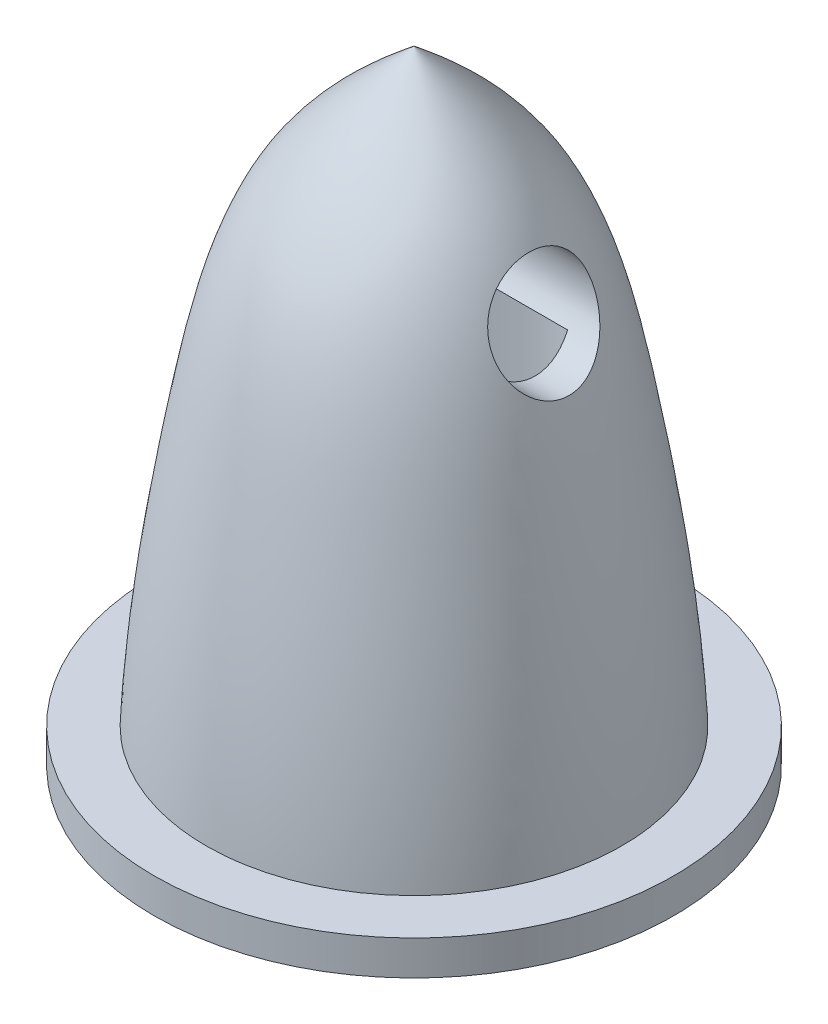
ISO-10303-21;
HEADER;
FILE_DESCRIPTION(('STEP AP214'),'2;1');
FILE_NAME('part.step','',(''),(''),'','','');
FILE_SCHEMA(('AUTOMOTIVE_DESIGN { 1 0 10303 214 1 1 1 1 }'));
ENDSEC;
DATA;
#1=APPLICATION_CONTEXT('core data for automotive mechanical design processes');
#2=APPLICATION_PROTOCOL_DEFINITION('international standard','automotive_design',2000,#1);
#3=PRODUCT_CONTEXT('',#1,'mechanical');
#4=PRODUCT('Part','Part','',(#3));
#5=PRODUCT_RELATED_PRODUCT_CATEGORY('part','',(#4));
#6=PRODUCT_DEFINITION_FORMATION('','',#4);
#7=PRODUCT_DEFINITION_CONTEXT('part definition',#1,'design');
#8=PRODUCT_DEFINITION('design','',#6,#7);
#9=PRODUCT_DEFINITION_SHAPE('','',#8);
#10=(LENGTH_UNIT() NAMED_UNIT(*) SI_UNIT(.MILLI.,.METRE.));
#11=(NAMED_UNIT(*) PLANE_ANGLE_UNIT() SI_UNIT($,.RADIAN.));
#12=(NAMED_UNIT(*) SI_UNIT($,.STERADIAN.) SOLID_ANGLE_UNIT());
#13=UNCERTAINTY_MEASURE_WITH_UNIT(LENGTH_MEASURE(1.E-05),#10,'distance_accuracy_value','');
#14=(GEOMETRIC_REPRESENTATION_CONTEXT(3) GLOBAL_UNCERTAINTY_ASSIGNED_CONTEXT((#13)) GLOBAL_UNIT_ASSIGNED_CONTEXT((#10,
#11,#12)) REPRESENTATION_CONTEXT('',''));
#15=CARTESIAN_POINT('',(0.,0.,0.));
#16=DIRECTION('',(0.,0.,1.));
#17=DIRECTION('',(1.,0.,0.));
#18=AXIS2_PLACEMENT_3D('',#15,#16,#17);
#19=CARTESIAN_POINT('',(0.,11.,0.));
#20=DIRECTION('',(0.,-1.,0.));
#21=DIRECTION('',(0.,0.,-1.));
#22=AXIS2_PLACEMENT_3D('',#19,#20,#21);
#23=PLANE('',#22);
#24=DIRECTION('',(1.,0.,0.));
#25=VECTOR('',#24,1.);
#26=CARTESIAN_POINT('',(-6.,11.,-1.1180339887499));
#27=LINE('',#26,#25);
#28=CARTESIAN_POINT('',(-3.3166247903554,11.,-1.1180339887499));
#29=VERTEX_POINT('',#28);
#30=CARTESIAN_POINT('',(3.3166247903554,11.,-1.1180339887499));
#31=VERTEX_POINT('',#30);
#32=EDGE_CURVE('E12',#29,#31,#27,.T.);
#33=ORIENTED_EDGE('',*,*,#32,.F.);
#34=CARTESIAN_POINT('',(0.,11.,0.));
#35=DIRECTION('',(0.,-1.,0.));
#36=DIRECTION('',(0.,0.,-1.));
#37=AXIS2_PLACEMENT_3D('',#34,#35,#36);
#38=CIRCLE('',#37,3.5);
#39=EDGE_CURVE('E103',#29,#31,#38,.T.);
#40=ORIENTED_EDGE('',*,*,#39,.T.);
#41=EDGE_LOOP('',(#33,#40));
#42=FACE_BOUND('',#41,.T.);
#43=ADVANCED_FACE('F61',(#42),#23,.T.);
#44=CARTESIAN_POINT('',(0.,-1.,0.));
#45=DIRECTION('',(0.,1.,0.));
#46=DIRECTION('',(0.,0.,1.));
#47=AXIS2_PLACEMENT_3D('',#44,#45,#46);
#48=CYLINDRICAL_SURFACE('',#47,7.5);
#49=CARTESIAN_POINT('',(0.,-1.,0.));
#50=DIRECTION('',(0.,-1.,0.));
#51=DIRECTION('',(0.,0.,-1.));
#52=AXIS2_PLACEMENT_3D('',#49,#50,#51);
#53=CIRCLE('',#52,7.5);
#54=CARTESIAN_POINT('',(0.,-1.,-7.5));
#55=VERTEX_POINT('',#54);
#56=EDGE_CURVE('E110',#55,#55,#53,.T.);
#57=ORIENTED_EDGE('',*,*,#56,.F.);
#58=EDGE_LOOP('',(#57));
#59=FACE_BOUND('',#58,.T.);
#60=CARTESIAN_POINT('',(0.,0.,0.));
#61=DIRECTION('',(0.,-1.,0.));
#62=DIRECTION('',(0.,0.,-1.));
#63=AXIS2_PLACEMENT_3D('',#60,#61,#62);
#64=CIRCLE('',#63,7.5);
#65=CARTESIAN_POINT('',(0.,0.,-7.5));
#66=VERTEX_POINT('',#65);
#67=EDGE_CURVE('E107',#66,#66,#64,.T.);
#68=ORIENTED_EDGE('',*,*,#67,.T.);
#69=EDGE_LOOP('',(#68));
#70=FACE_BOUND('',#69,.T.);
#71=ADVANCED_FACE('F144',(#59,#70),#48,.T.);
#72=CARTESIAN_POINT('',(0.,-1.,0.));
#73=DIRECTION('',(0.,-1.,0.));
#74=DIRECTION('',(0.,0.,-1.));
#75=AXIS2_PLACEMENT_3D('',#72,#73,#74);
#76=PLANE('',#75);
#77=CARTESIAN_POINT('',(0.,-1.,0.));
#78=DIRECTION('',(0.,-1.,0.));
#79=DIRECTION('',(0.,0.,-1.));
#80=AXIS2_PLACEMENT_3D('',#77,#78,#79);
#81=CIRCLE('',#80,3.5);
#82=CARTESIAN_POINT('',(0.,-1.,-3.5));
#83=VERTEX_POINT('',#82);
#84=EDGE_CURVE('E112',#83,#83,#81,.T.);
#85=ORIENTED_EDGE('',*,*,#84,.F.);
#86=EDGE_LOOP('',(#85));
#87=FACE_BOUND('',#86,.T.);
#88=ORIENTED_EDGE('',*,*,#56,.T.);
#89=EDGE_LOOP('',(#88));
#90=FACE_BOUND('',#89,.T.);
#91=ADVANCED_FACE('F142',(#87,#90),#76,.T.);
#92=CARTESIAN_POINT('',(0.,0.,0.));
#93=DIRECTION('',(0.,-1.,0.));
#94=DIRECTION('',(0.,0.,-1.));
#95=AXIS2_PLACEMENT_3D('',#92,#93,#94);
#96=PLANE('',#95);
#97=CARTESIAN_POINT('',(0.,0.,0.));
#98=DIRECTION('',(0.,1.,0.));
#99=DIRECTION('',(0.,0.,1.));
#100=AXIS2_PLACEMENT_3D('',#97,#98,#99);
#101=CIRCLE('',#100,6.);
#102=CARTESIAN_POINT('',(0.,0.,6.));
#103=VERTEX_POINT('',#102);
#104=EDGE_CURVE('E96',#103,#103,#101,.T.);
#105=ORIENTED_EDGE('',*,*,#104,.F.);
#106=EDGE_LOOP('',(#105));
#107=FACE_BOUND('',#106,.T.);
#108=ORIENTED_EDGE('',*,*,#67,.F.);
#109=EDGE_LOOP('',(#108));
#110=FACE_BOUND('',#109,.T.);
#111=ADVANCED_FACE('F133',(#107,#110),#96,.F.);
#112=CARTESIAN_POINT('',(-1.63771161310395,0.,5.77216602951651));
#113=CARTESIAN_POINT('',(-1.25604982510826,2.70999310695008,5.74792936969275));
#114=CARTESIAN_POINT('',(-0.635456728813944,7.31760669771987,5.1568188376751));
#115=CARTESIAN_POINT('',(-0.352139289046343,13.7590379220788,3.85194242465393));
#116=CARTESIAN_POINT('',(-0.100865045013086,16.07167477319,1.10333143201014));
#117=CARTESIAN_POINT('',(0.,17.000000002,0.));
#118=CARTESIAN_POINT('',(-0.882136892437624,0.,5.98654196539144));
#119=CARTESIAN_POINT('',(-0.503646763529838,2.70999312095589,5.91235254958714));
#120=CARTESIAN_POINT('',(0.0395689066733885,7.31760669263702,5.23999750976852));
#121=CARTESIAN_POINT('',(0.152078810977699,13.7590379227889,3.89803768425039));
#122=CARTESIAN_POINT('',(0.0435607062090235,16.0716747733933,1.11653473132581));
#123=CARTESIAN_POINT('',(0.,17.000000002,0.));
#124=CARTESIAN_POINT('',(0.71384083025026,0.,6.11502855023513));
#125=CARTESIAN_POINT('',(1.0661409577533,2.70999776741628,5.94219115082974));
#126=CARTESIAN_POINT('',(1.42235793060396,7.31760500638751,5.13815613528719));
#127=CARTESIAN_POINT('',(1.17872221394427,13.7590381583456,3.78987603233073));
#128=CARTESIAN_POINT('',(0.337627390256263,16.071674840865,1.08555344003306));
#129=CARTESIAN_POINT('',(0.,17.000000002,0.));
#130=CARTESIAN_POINT('',(2.99974212154382,0.,5.37610548765391));
#131=CARTESIAN_POINT('',(3.25906203455601,2.70999510867615,5.08160902885469));
#132=CARTESIAN_POINT('',(3.28044048658949,7.31760597127237,4.20247574740558));
#133=CARTESIAN_POINT('',(2.53927327409422,13.7590380235582,3.05016393498515));
#134=CARTESIAN_POINT('',(0.727336940406932,16.0716748022572,0.873673947126867));
#135=CARTESIAN_POINT('',(0.,17.000000002,0.));
#136=CARTESIAN_POINT('',(4.82869105918587,0.,3.81906030783793));
#137=CARTESIAN_POINT('',(4.95558505465482,2.70999625310538,3.44774526542495));
#138=CARTESIAN_POINT('',(4.63892720870308,7.31760555594693,2.62734319795501));
#139=CARTESIAN_POINT('',(3.51322865939837,13.7590380815762,1.8463378548351));
#140=CARTESIAN_POINT('',(1.00631192796224,16.0716748188756,0.528855928975302));
#141=CARTESIAN_POINT('',(0.,17.000000002,0.));
#142=CARTESIAN_POINT('',(5.92266548789641,0.,1.6803836373626));
#143=CARTESIAN_POINT('',(5.89779365186575,2.70999592627188,1.28876682822311));
#144=CARTESIAN_POINT('',(5.29126931936783,7.31760567455823,0.651989804057528));
#145=CARTESIAN_POINT('',(3.95236241735653,13.759038065007,0.361309095362077));
#146=CARTESIAN_POINT('',(1.13209524053486,16.0716748141296,0.103491599207884));
#147=CARTESIAN_POINT('',(0.,17.000000002,0.));
#148=CARTESIAN_POINT('',(6.11486138425387,0.,-0.714025674898327));
#149=CARTESIAN_POINT('',(5.94202187773725,2.70999568297413,-1.06630218542331));
#150=CARTESIAN_POINT('',(5.13798913040761,7.31760576285357,-1.42248468992361));
#151=CARTESIAN_POINT('',(3.78977378527252,13.7590380526728,-1.1786824222702));
#152=CARTESIAN_POINT('',(1.08552415288888,16.0716748105967,-0.337615992524966));
#153=CARTESIAN_POINT('',(0.,17.000000002,0.));
#154=CARTESIAN_POINT('',(5.37614790683815,0.,-2.99975491372685));
#155=CARTESIAN_POINT('',(5.08164780454236,2.70999669982789,-3.2590934754347));
#156=CARTESIAN_POINT('',(4.20250283246498,7.31760539382662,-3.280505239161));
#157=CARTESIAN_POINT('',(3.05024126916232,13.7590381042232,-2.53921716056614));
#158=CARTESIAN_POINT('',(0.873696098348003,16.0716748253625,-0.727320867524091));
#159=CARTESIAN_POINT('',(0.,17.000000002,0.));
#160=CARTESIAN_POINT('',(3.81895824410904,0.,-4.82877220781337));
#161=CARTESIAN_POINT('',(3.44763809473317,2.70999311461883,-4.95562886197896));
#162=CARTESIAN_POINT('',(2.6272247999729,7.31760669493676,-4.6389121088972));
#163=CARTESIAN_POINT('',(1.84637729365055,13.7590379224677,-3.51324903623568));
#164=CARTESIAN_POINT('',(0.528867225635514,16.0716747733013,-1.00631776460324));
#165=CARTESIAN_POINT('',(0.,17.000000002,0.));
#166=CARTESIAN_POINT('',(1.68039992903456,0.,-5.92262234007832));
#167=CARTESIAN_POINT('',(1.28879681547105,2.71000178920933,-5.89780900009984));
#168=CARTESIAN_POINT('',(0.652040128986993,7.31760354683644,-5.29137711098396));
#169=CARTESIAN_POINT('',(0.36131470629204,13.7590383622341,-3.9523201520249));
#170=CARTESIAN_POINT('',(0.10349320637505,16.0716748992659,-1.13208313426126));
#171=CARTESIAN_POINT('',(0.,17.000000002,0.));
#172=CARTESIAN_POINT('',(-0.713963734535338,0.,-6.11487848538034));
#173=CARTESIAN_POINT('',(-1.06625717603406,2.70999272123677,-5.9420152196477));
#174=CARTESIAN_POINT('',(-1.42245923032158,7.31760683769923,-5.13794328948983));
#175=CARTESIAN_POINT('',(-1.17874152322678,13.7590379025249,-3.78980167150487));
#176=CARTESIAN_POINT('',(-0.33763292111212,16.071674767589,-1.08553214048404));
#177=CARTESIAN_POINT('',(0.,17.000000002,0.));
#178=CARTESIAN_POINT('',(-2.99967702524025,0.,-5.37619136590899));
#179=CARTESIAN_POINT('',(-3.25900048738126,2.7099973817705,-5.08171026880177));
#180=CARTESIAN_POINT('',(-3.28038670640696,7.31760514634248,-4.20259636613019));
#181=CARTESIAN_POINT('',(-2.53926499119674,13.7590381387948,-3.05020243148964));
#182=CARTESIAN_POINT('',(-0.727334567894539,16.071674835265,-0.873684973876165));
#183=CARTESIAN_POINT('',(0.,17.000000002,0.));
#184=CARTESIAN_POINT('',(-4.82872512534189,0.,-3.81900197393836));
#185=CARTESIAN_POINT('',(-4.9556166556086,2.70999534252388,-3.44767700805406));
#186=CARTESIAN_POINT('',(-4.63895387076203,7.31760588640654,-2.62726370669749));
#187=CARTESIAN_POINT('',(-3.51323272926211,13.7590380354134,-1.84631323273857));
#188=CARTESIAN_POINT('',(-1.00631309371398,16.071674805653,-0.528848876343143));
#189=CARTESIAN_POINT('',(0.,17.000000002,0.));
#190=CARTESIAN_POINT('',(-5.92265050266062,0.,-1.68043645329688));
#191=CARTESIAN_POINT('',(-5.89778109438855,2.70999616638537,-1.28882733831909));
#192=CARTESIAN_POINT('',(-5.29126080116593,7.31760558741851,-0.652058047836621));
#193=CARTESIAN_POINT('',(-3.95236069048251,13.7590380771797,-0.361329810108821));
#194=CARTESIAN_POINT('',(-1.13209474589757,16.0716748176163,-0.103497532638));
#195=CARTESIAN_POINT('',(0.,17.000000002,0.));
#196=CARTESIAN_POINT('',(-6.11486302962719,0.,0.714093207405831));
#197=CARTESIAN_POINT('',(-5.94202014283973,2.70999607751274,1.06637804609691));
#198=CARTESIAN_POINT('',(-5.1379827898571,7.31760561967134,1.42256783373678));
#199=CARTESIAN_POINT('',(-3.78977384698272,13.7590380726744,1.17870736520125));
#200=CARTESIAN_POINT('',(-1.08552417056485,16.0716748163258,0.337623137055385));
#201=CARTESIAN_POINT('',(0.,17.000000002,0.));
#202=CARTESIAN_POINT('',(-5.37615820235245,0.,2.99964764487854));
#203=CARTESIAN_POINT('',(-5.08166373830636,2.70999499344091,3.25897389652202));
#204=CARTESIAN_POINT('',(-4.20252535014489,7.31760601309246,3.28037641620713));
#205=CARTESIAN_POINT('',(-3.05024305245382,13.7590380177163,2.53917781167508));
#206=CARTESIAN_POINT('',(-0.873696609145243,16.0716748005839,0.727309596621379));
#207=CARTESIAN_POINT('',(0.,17.000000002,0.));
#208=CARTESIAN_POINT('',(-3.81893246349521,0.,4.82896445838913));
#209=CARTESIAN_POINT('',(-3.44760238146475,2.70999768338142,4.95584359486691));
#210=CARTESIAN_POINT('',(-2.62717902537418,7.31760503688464,4.63913977143844));
#211=CARTESIAN_POINT('',(-1.84637073502826,13.7590381540853,3.51332580288577));
#212=CARTESIAN_POINT('',(-0.528865347016021,16.0716748396448,1.00633975326471));
#213=CARTESIAN_POINT('',(0.,17.000000002,0.));
#214=CARTESIAN_POINT('',(-2.39328633377028,0.,5.5577900936416));
#215=CARTESIAN_POINT('',(-2.00845288668669,2.70999309294427,5.58350618979836));
#216=CARTESIAN_POINT('',(-1.31048236430128,7.31760670280273,5.07364016558169));
#217=CARTESIAN_POINT('',(-0.856357389070385,13.7590379213688,3.80584716505747));
#218=CARTESIAN_POINT('',(-0.245290796235195,16.0716747729866,1.09012813269447));
#219=CARTESIAN_POINT('',(0.,17.000000002,0.));
#220=CARTESIAN_POINT('',(-1.63771161310395,0.,5.77216602951651));
#221=CARTESIAN_POINT('',(-1.25604982510826,2.70999310695008,5.74792936969275));
#222=CARTESIAN_POINT('',(-0.635456728813944,7.31760669771987,5.1568188376751));
#223=CARTESIAN_POINT('',(-0.352139289046343,13.7590379220788,3.85194242465393));
#224=CARTESIAN_POINT('',(-0.100865045013086,16.07167477319,1.10333143201014));
#225=CARTESIAN_POINT('',(0.,17.000000002,0.));
#226=B_SPLINE_SURFACE_WITH_KNOTS('',3,3,((#112,#113,#114,#115,#116,#117),(#118,#119,#120,#121,
#122,#123),(#124,#125,#126,#127,#128,#129),(#130,#131,#132,#133,#134,#135),(#136,#137,#138,#139,
#140,#141),(#142,#143,#144,#145,#146,#147),(#148,#149,#150,#151,#152,#153),(#154,#155,#156,#157,
#158,#159),(#160,#161,#162,#163,#164,#165),(#166,#167,#168,#169,#170,#171),(#172,#173,#174,#175,
#176,#177),(#178,#179,#180,#181,#182,#183),(#184,#185,#186,#187,#188,#189),(#190,#191,#192,#193,
#194,#195),(#196,#197,#198,#199,#200,#201),(#202,#203,#204,#205,#206,#207),(#208,#209,#210,#211,
#212,#213),(#214,#215,#216,#217,#218,#219),(#220,#221,#222,#223,#224,#225)),.UNSPECIFIED.,.T.,
.F.,.F.,(4,1,1,1,1,1,1,1,1,1,1,1,1,1,1,1,4),(4,1,1,4),(0.,0.0625,0.125,0.1875,0.25,0.3125,0.375,
0.4375,0.5,0.5625,0.625,0.6875,0.75,0.8125,0.875,0.9375,1.),(0.,0.433808072360645,
0.7727225307667,1.),.UNSPECIFIED.);
#227=CARTESIAN_POINT('',(3.72182288843976,12.,-1.5));
#228=CARTESIAN_POINT('',(3.69009587132793,12.0791147561372,-1.49999915390611));
#229=CARTESIAN_POINT('',(3.65962382054876,12.1587437580533,-1.49373373169126));
#230=CARTESIAN_POINT('',(3.60207948226084,12.3171960321081,-1.46827256740218));
#231=CARTESIAN_POINT('',(3.57500750567946,12.3960192299537,-1.44907564379796));
#232=CARTESIAN_POINT('',(3.52299412512389,12.5567740656765,-1.39560792813917));
#233=CARTESIAN_POINT('',(3.49838622717911,12.6384648127279,-1.36027320813417));
#234=CARTESIAN_POINT('',(3.45440345519364,12.7953384068847,-1.27491337528828));
#235=CARTESIAN_POINT('',(3.4350276904303,12.8705223602294,-1.22489076595622));
#236=CARTESIAN_POINT('',(3.40264531024479,13.0061573765305,-1.11564687692726));
#237=CARTESIAN_POINT('',(3.38927550920777,13.0672848574965,-1.05737064626771));
#238=CARTESIAN_POINT('',(3.36646485942254,13.1791784314457,-0.930945901099683));
#239=CARTESIAN_POINT('',(3.35702333355027,13.2299463093634,-0.862799090733725));
#240=CARTESIAN_POINT('',(3.34164399473142,13.3181676463064,-0.720589768218267));
#241=CARTESIAN_POINT('',(3.33561881942464,13.3559423308618,-0.646735522564226));
#242=CARTESIAN_POINT('',(3.32608649130179,13.4188483300371,-0.493675275434253));
#243=CARTESIAN_POINT('',(3.32257932410256,13.4439797168769,-0.414469304530844));
#244=CARTESIAN_POINT('',(3.31759255670065,13.4809120741353,-0.252619985888933));
#245=CARTESIAN_POINT('',(3.31612098345765,13.4926602385503,-0.169964346488386));
#246=CARTESIAN_POINT('',(3.31496142758558,13.5023012159474,-0.00383406004377979));
#247=CARTESIAN_POINT('',(3.31527353014398,13.5001933671724,0.0796406259274692));
#248=CARTESIAN_POINT('',(3.31766698530953,13.4821380768369,0.245473697775928));
#249=CARTESIAN_POINT('',(3.319757076966,13.4661222677185,0.327824524825633));
#250=CARTESIAN_POINT('',(3.32604586849239,13.4206380093808,0.488640479067789));
#251=CARTESIAN_POINT('',(3.33024453806417,13.3911697534603,0.567105662075243));
#252=CARTESIAN_POINT('',(3.34139034691308,13.3197468811054,0.717779943004631));
#253=CARTESIAN_POINT('',(3.34833337906733,13.2778109465276,0.789998193923583));
#254=CARTESIAN_POINT('',(3.36563355003726,13.1827968822871,0.926221230604366));
#255=CARTESIAN_POINT('',(3.3759902738485,13.1297201073074,0.990227013447254));
#256=CARTESIAN_POINT('',(3.40058559617348,13.0146688459745,1.10777118525337));
#257=CARTESIAN_POINT('',(3.4147926878893,12.9527684301233,1.16138872440958));
#258=CARTESIAN_POINT('',(3.44742886971455,12.8218371830252,1.25744878930409));
#259=CARTESIAN_POINT('',(3.46585790284445,12.7528064480163,1.29989146584226));
#260=CARTESIAN_POINT('',(3.50708013751538,12.6092607588369,1.37307942684135));
#261=CARTESIAN_POINT('',(3.5299081843507,12.5347051563712,1.40372502821592));
#262=CARTESIAN_POINT('',(3.57944985944099,12.3828576467719,1.45250999444982));
#263=CARTESIAN_POINT('',(3.60616440642961,12.3055650959261,1.47064639641112));
#264=CARTESIAN_POINT('',(3.66432734454575,12.146133495961,1.4951563584074));
#265=CARTESIAN_POINT('',(3.6959520148862,12.0639554541145,1.50085246244419));
#266=CARTESIAN_POINT('',(3.76179409208288,11.900804968577,1.49894055986392));
#267=CARTESIAN_POINT('',(3.79601251514174,11.8198330124378,1.49132731275236));
#268=CARTESIAN_POINT('',(3.86895689580967,11.6538953080986,1.46216002049422));
#269=CARTESIAN_POINT('',(3.90781659647152,11.5691908548578,1.43945591992562));
#270=CARTESIAN_POINT('',(3.98578581182955,11.4050464024371,1.37973027376048));
#271=CARTESIAN_POINT('',(4.02489538395818,11.325607665075,1.34270531089501));
#272=CARTESIAN_POINT('',(4.08353367672594,11.209778524634,1.27580822308499));
#273=CARTESIAN_POINT('',(4.10358832540002,11.1707729693597,1.25081373286324));
#274=CARTESIAN_POINT('',(4.14303337730597,11.0950641753759,1.19718119979176));
#275=CARTESIAN_POINT('',(4.16242437885536,11.0583588366647,1.16854655479074));
#276=CARTESIAN_POINT('',(4.21924894894818,10.9520527035933,1.0772725589037));
#277=CARTESIAN_POINT('',(4.25535491570416,10.8862210935584,1.00923978481195));
#278=CARTESIAN_POINT('',(4.31999812406535,10.7703275623232,0.863794089347581));
#279=CARTESIAN_POINT('',(4.3488155844813,10.7196601229606,0.786988582151957));
#280=CARTESIAN_POINT('',(4.39886069076119,10.6325751988893,0.623451881642819));
#281=CARTESIAN_POINT('',(4.42009887628319,10.5961379191646,0.53673469485684));
#282=CARTESIAN_POINT('',(4.45077495953598,10.5437042800688,0.368615450562538));
#283=CARTESIAN_POINT('',(4.46142306400897,10.5256050651484,0.288088976875614));
#284=CARTESIAN_POINT('',(4.47475941269698,10.5029054073366,0.124524658744916));
#285=CARTESIAN_POINT('',(4.47745375567758,10.498294621845,0.0414887878346237));
#286=CARTESIAN_POINT('',(4.47484142117014,10.5025937712772,-0.115025738134354));
#287=CARTESIAN_POINT('',(4.47037189372306,10.5100897080495,-0.18856296658311));
#288=CARTESIAN_POINT('',(4.4552814794517,10.5356171761651,-0.333119107223494));
#289=CARTESIAN_POINT('',(4.44466080802243,10.5536483385959,-0.404138107503673));
#290=CARTESIAN_POINT('',(4.41788751186802,10.5994847161847,-0.542090557587252));
#291=CARTESIAN_POINT('',(4.401716031553,10.6273232547114,-0.609009153444395));
#292=CARTESIAN_POINT('',(4.36473512573237,10.6916546187792,-0.737141046176467));
#293=CARTESIAN_POINT('',(4.34392434136803,10.728149980117,-0.798352664004298));
#294=CARTESIAN_POINT('',(4.29644413617156,10.8124960253062,-0.91967638463428));
#295=CARTESIAN_POINT('',(4.26940388012737,10.8611009418434,-0.97911743737611));
#296=CARTESIAN_POINT('',(4.21210379927002,10.9659099344492,-1.0892438243006));
#297=CARTESIAN_POINT('',(4.18183803612947,11.0221280802145,-1.13991254204243));
#298=CARTESIAN_POINT('',(4.11522798832438,11.1484862552748,-1.23778431185012));
#299=CARTESIAN_POINT('',(4.07860416790262,11.2194863512576,-1.28368818923304));
#300=CARTESIAN_POINT('',(4.00434577010917,11.3677350298568,-1.36282963144484));
#301=CARTESIAN_POINT('',(3.96671100987885,11.4449847480569,-1.39606488803506));
#302=CARTESIAN_POINT('',(3.89352150121938,11.6006101348207,-1.44807376139474));
#303=CARTESIAN_POINT('',(3.85794823752711,11.6787857797555,-1.46742069361544));
#304=CARTESIAN_POINT('',(3.78841669103884,11.8377958547623,-1.49337425171397));
#305=CARTESIAN_POINT('',(3.75445595589389,11.9186259091253,-1.50000087025638));
#306=CARTESIAN_POINT('',(3.72182288843976,12.,-1.5));
#307=B_SPLINE_CURVE_WITH_KNOTS('',3,(#227,#228,#229,#230,#231,#232,#233,#234,#235,#236,#237,
#238,#239,#240,#241,#242,#243,#244,#245,#246,#247,#248,#249,#250,#251,#252,#253,#254,#255,#256,
#257,#258,#259,#260,#261,#262,#263,#264,#265,#266,#267,#268,#269,#270,#271,#272,#273,#274,#275,
#276,#277,#278,#279,#280,#281,#282,#283,#284,#285,#286,#287,#288,#289,#290,#291,#292,#293,#294,
#295,#296,#297,#298,#299,#300,#301,#302,#303,#304,#305,#306),.UNSPECIFIED.,.T.,.F.,(4,2,2,2,2,2,
2,2,2,2,2,2,2,2,2,2,2,2,2,2,2,2,2,2,2,2,2,2,2,2,2,2,2,2,2,2,2,2,2,4),(0.,0.255468849844969,
0.510961044624465,0.786486616863992,1.0619652537901,1.31721765035625,1.57242603034734,
1.82077403565701,2.06912062236189,2.31844374932347,2.56777878393427,2.81834646119474,
3.06891053815253,3.31910104035611,3.5692611379682,3.81743299921156,4.06560151131296,
4.31582323514679,4.5661042055456,4.82970638264492,5.09341237524196,5.37995276455203,
5.66656157084946,5.81783737075227,5.96897298731098,6.27109226181767,6.55870184487257,
6.84590990821753,7.09414393044216,7.34218756289299,7.56329311529032,7.78439092568838,
8.00624734220114,8.22816882635231,8.47141842314772,8.71512385545459,8.99039859980693,
9.26572347561783,9.52890190623079,9.79166635647948),.UNSPECIFIED.);
#308=CARTESIAN_POINT('',(3.72182288843976,12.,-1.5));
#309=VERTEX_POINT('',#308);
#310=EDGE_CURVE('E115',#309,#309,#307,.T.);
#311=CARTESIAN_POINT('',(-3.72178622870527,12.,-1.5));
#312=CARTESIAN_POINT('',(-3.75342866731429,11.9210685084638,-1.49999919861984));
#313=CARTESIAN_POINT('',(-3.78632387484832,11.8426200917603,-1.4937627378255));
#314=CARTESIAN_POINT('',(-3.85362912163976,11.6882281248203,-1.46932629631601));
#315=CARTESIAN_POINT('',(-3.88804067876629,11.6122872239893,-1.45111406179807));
#316=CARTESIAN_POINT('',(-3.96283399427915,11.452485463413,-1.39941263580272));
#317=CARTESIAN_POINT('',(-4.00329317747281,11.369291318168,-1.36395126007851));
#318=CARTESIAN_POINT('',(-4.08305304260473,11.2101276154224,-1.2783866136475));
#319=CARTESIAN_POINT('',(-4.12235311668836,11.1341618036691,-1.2282758057377));
#320=CARTESIAN_POINT('',(-4.19845366357318,10.9904835260361,-1.11331484991679));
#321=CARTESIAN_POINT('',(-4.23520561428416,10.9229181974362,-1.04824708973307));
#322=CARTESIAN_POINT('',(-4.30325453937775,10.8000318843091,-0.90496659355148));
#323=CARTESIAN_POINT('',(-4.33455526222397,10.7447024787936,-0.82676296353105));
#324=CARTESIAN_POINT('',(-4.38673397449927,10.6535512411236,-0.666888959864487));
#325=CARTESIAN_POINT('',(-4.40830895395053,10.6163969613779,-0.586211120117732));
#326=CARTESIAN_POINT('',(-4.44316222900457,10.5566602284061,-0.417977319990393));
#327=CARTESIAN_POINT('',(-4.45645181750201,10.5340579395998,-0.33043090556262));
#328=CARTESIAN_POINT('',(-4.47234660127531,10.5070110089997,-0.164428243550544));
#329=CARTESIAN_POINT('',(-4.47619333636569,10.5004567679936,-0.0864291091542928));
#330=CARTESIAN_POINT('',(-4.47663442762938,10.4995901651204,0.0696480856781795));
#331=CARTESIAN_POINT('',(-4.47323143497726,10.5052733281287,0.147726106829307));
#332=CARTESIAN_POINT('',(-4.45991028081818,10.5277671199828,0.29631928826033));
#333=CARTESIAN_POINT('',(-4.45043836379834,10.5438161585954,0.366992926971498));
#334=CARTESIAN_POINT('',(-4.42601286583917,10.5855342855834,0.504426104275689));
#335=CARTESIAN_POINT('',(-4.41105867266479,10.6112044484081,0.571185204745093));
#336=CARTESIAN_POINT('',(-4.37566003845475,10.6725705751541,0.702444806020136));
#337=CARTESIAN_POINT('',(-4.35498832798683,10.7086852621847,0.766686926415341));
#338=CARTESIAN_POINT('',(-4.30956624308506,10.7890705103108,0.888237189789788));
#339=CARTESIAN_POINT('',(-4.28481416893529,10.8333444711429,0.945542425815108));
#340=CARTESIAN_POINT('',(-4.22915820688185,10.9344700522541,1.05880796435216));
#341=CARTESIAN_POINT('',(-4.19787287971915,10.992190596385,1.11380292611651));
#342=CARTESIAN_POINT('',(-4.13284992391437,11.1147650138037,1.21350945985712));
#343=CARTESIAN_POINT('',(-4.09911052318832,11.1796240594911,1.25821350178482));
#344=CARTESIAN_POINT('',(-4.04554472248521,11.2853182389396,1.31953169215512));
#345=CARTESIAN_POINT('',(-4.0260973442532,11.3242325777389,1.33987285992621));
#346=CARTESIAN_POINT('',(-3.98706983957381,11.4035885344198,1.37702994993573));
#347=CARTESIAN_POINT('',(-3.9674898569044,11.4440286651726,1.39384920518042));
#348=CARTESIAN_POINT('',(-3.90879849717271,11.5674220327074,1.4389380774781));
#349=CARTESIAN_POINT('',(-3.86974071904157,11.6524384505055,1.46183313739381));
#350=CARTESIAN_POINT('',(-3.79144573895925,11.8303552027528,1.49325031802127));
#351=CARTESIAN_POINT('',(-3.75230117933445,11.9234364468582,1.50097897478557));
#352=CARTESIAN_POINT('',(-3.67763425511501,12.1108761764934,1.49882479437684));
#353=CARTESIAN_POINT('',(-3.64211063085332,12.2052342048207,1.48894810408841));
#354=CARTESIAN_POINT('',(-3.57783365060005,12.3872364330149,1.45197061503931));
#355=CARTESIAN_POINT('',(-3.54882508772945,12.4749753965523,1.42578749622641));
#356=CARTESIAN_POINT('',(-3.49622146257792,12.64554528352,1.35709471948795));
#357=CARTESIAN_POINT('',(-3.47262275926442,12.7283794800232,1.31459609432221));
#358=CARTESIAN_POINT('',(-3.43296781879643,12.8786798903224,1.21866821293762));
#359=CARTESIAN_POINT('',(-3.41642681394083,12.94685780086,1.16655070585307));
#360=CARTESIAN_POINT('',(-3.38779800745622,13.0737923483183,1.05087414680856));
#361=CARTESIAN_POINT('',(-3.37570926711777,13.132550969712,0.987317510870757));
#362=CARTESIAN_POINT('',(-3.35584669753435,13.236107096418,0.853734761260527));
#363=CARTESIAN_POINT('',(-3.34790383600579,13.2814120934469,0.78412599141474));
#364=CARTESIAN_POINT('',(-3.33492479517648,13.3599986125222,0.638178294769713));
#365=CARTESIAN_POINT('',(-3.3298884895465,13.3932806571053,0.561839660640524));
#366=CARTESIAN_POINT('',(-3.32215429380816,13.4467515701019,0.404709332624253));
#367=CARTESIAN_POINT('',(-3.3194534065855,13.4669572114591,0.323923488103643));
#368=CARTESIAN_POINT('',(-3.31596591537872,13.493741840264,0.16008180644831));
#369=CARTESIAN_POINT('',(-3.31517938688845,13.5003202903139,0.0770258799221888));
#370=CARTESIAN_POINT('',(-3.31534846800177,13.4996536608506,-0.0895377784409776));
#371=CARTESIAN_POINT('',(-3.31631475375612,13.4923238555365,-0.173045169408994));
#372=CARTESIAN_POINT('',(-3.32009265713194,13.4638898924501,-0.337640914412174));
#373=CARTESIAN_POINT('',(-3.3229043182211,13.4427854102165,-0.418729211418727));
#374=CARTESIAN_POINT('',(-3.33086288306253,13.3874124374031,-0.576248249585094));
#375=CARTESIAN_POINT('',(-3.3360119858462,13.3531315553224,-0.652674527805285));
#376=CARTESIAN_POINT('',(-3.34931853792635,13.2724903137815,-0.798569697283115));
#377=CARTESIAN_POINT('',(-3.35747562259749,13.2261314186089,-0.868039430510674));
#378=CARTESIAN_POINT('',(-3.37737608365414,13.123231934759,-0.997568295249577));
#379=CARTESIAN_POINT('',(-3.38909339275975,13.0667665394327,-1.05769117992582));
#380=CARTESIAN_POINT('',(-3.41661339056675,12.9453272211032,-1.16750065423209));
#381=CARTESIAN_POINT('',(-3.43241619267858,12.8803530619272,-1.21718695408038));
#382=CARTESIAN_POINT('',(-3.46828888377801,12.7440964551077,-1.30494780947768));
#383=CARTESIAN_POINT('',(-3.48835773014876,12.6728155513065,-1.34302519670796));
#384=CARTESIAN_POINT('',(-3.53260144531248,12.5262023054001,-1.4069486540666));
#385=CARTESIAN_POINT('',(-3.55677503015853,12.4508712351917,-1.43279853936942));
#386=CARTESIAN_POINT('',(-3.6038089621266,12.3127548146369,-1.46842435026691));
#387=CARTESIAN_POINT('',(-3.62605309558458,12.2502910793661,-1.48031560368508));
#388=CARTESIAN_POINT('',(-3.67253272145383,12.1251175393225,-1.49610311166253));
#389=CARTESIAN_POINT('',(-3.69676789755415,12.0624077751372,-1.50000063361723));
#390=CARTESIAN_POINT('',(-3.72178622870527,12.,-1.5));
#391=B_SPLINE_CURVE_WITH_KNOTS('',3,(#311,#312,#313,#314,#315,#316,#317,#318,#319,#320,#321,
#322,#323,#324,#325,#326,#327,#328,#329,#330,#331,#332,#333,#334,#335,#336,#337,#338,#339,#340,
#341,#342,#343,#344,#345,#346,#347,#348,#349,#350,#351,#352,#353,#354,#355,#356,#357,#358,#359,
#360,#361,#362,#363,#364,#365,#366,#367,#368,#369,#370,#371,#372,#373,#374,#375,#376,#377,#378,
#379,#380,#381,#382,#383,#384,#385,#386,#387,#388,#389,#390),.UNSPECIFIED.,.T.,.F.,(4,2,2,2,2,2,
2,2,2,2,2,2,2,2,2,2,2,2,2,2,2,2,2,2,2,2,2,2,2,2,2,2,2,2,2,2,2,2,2,4),(0.,0.254922774707696,
0.51010679720181,0.805961234042846,1.10196815811321,1.40258994915922,1.70300419838338,
1.97558442532392,2.24779231156336,2.48164828425667,2.71541875214171,2.93371271236147,
3.15203105806341,3.38073149375783,3.60952743874016,3.86545518958455,4.12156961623889,
4.26550241248901,4.40929837429409,4.69692699586434,4.99924006597286,5.30144760453052,
5.58801785835208,5.8743946699624,6.13524847671779,6.39604725388141,6.64516330683772,
6.8942685315109,7.14305359529587,7.39184846990584,7.64216381130323,7.89248504907082,
8.14304227507198,8.39356913869089,8.64230417480138,8.89104611636503,9.1397273354047,
9.38833091069565,9.58991947646611,9.79147607816816),.UNSPECIFIED.);
#392=CARTESIAN_POINT('',(-3.72178622870527,12.,-1.5));
#393=VERTEX_POINT('',#392);
#394=EDGE_CURVE('E104',#393,#393,#391,.T.);
#395=ORIENTED_EDGE('',*,*,#310,.F.);
#396=EDGE_LOOP('',(#395));
#397=FACE_BOUND('',#396,.T.);
#398=ORIENTED_EDGE('',*,*,#394,.F.);
#399=EDGE_LOOP('',(#398));
#400=FACE_BOUND('',#399,.T.);
#401=CARTESIAN_POINT('',(0.,17.000000002,0.));
#402=VERTEX_POINT('',#401);
#403=VERTEX_LOOP('',#402);
#404=FACE_BOUND('',#403,.T.);
#405=ORIENTED_EDGE('',*,*,#104,.T.);
#406=EDGE_LOOP('',(#405));
#407=FACE_BOUND('',#406,.T.);
#408=ADVANCED_FACE('F63',(#397,#400,#404,#407),#226,.T.);
#409=CARTESIAN_POINT('',(0.,11.,0.));
#410=DIRECTION('',(0.,-1.,0.));
#411=DIRECTION('',(0.,0.,-1.));
#412=AXIS2_PLACEMENT_3D('',#409,#410,#411);
#413=CYLINDRICAL_SURFACE('',#412,3.5);
#414=ORIENTED_EDGE('',*,*,#39,.F.);
#415=CARTESIAN_POINT('',(-3.3166247903554,11.,-1.1180339887499));
#416=CARTESIAN_POINT('',(-3.33547430669805,10.9375826597817,-1.06224783080584));
#417=CARTESIAN_POINT('',(-3.35445223641776,10.8798668628064,-1.00118115179079));
#418=CARTESIAN_POINT('',(-3.39086712795343,10.7750673205338,-0.869825593944227));
#419=CARTESIAN_POINT('',(-3.40829951999125,10.7280145040273,-0.799510799438348));
#420=CARTESIAN_POINT('',(-3.43972800906553,10.6460607073983,-0.651185252283471));
#421=CARTESIAN_POINT('',(-3.45371709388426,10.6111844651726,-0.573159241196201));
#422=CARTESIAN_POINT('',(-3.47664793259975,10.5550972417348,-0.41174719339449));
#423=CARTESIAN_POINT('',(-3.48559792233623,10.5338639545632,-0.328370152312087));
#424=CARTESIAN_POINT('',(-3.49711108647072,10.5067060645951,-0.163356772616104));
#425=CARTESIAN_POINT('',(-3.49999196605732,10.5000193136993,-0.0818681136947746));
#426=CARTESIAN_POINT('',(-3.50000799448853,10.4999807783342,0.0811251913925836));
#427=CARTESIAN_POINT('',(-3.49714287808214,10.5066296094723,0.162629838122984));
#428=CARTESIAN_POINT('',(-3.4862426181109,10.5323446009403,0.319386508973181));
#429=CARTESIAN_POINT('',(-3.47845208129795,10.550823761757,0.394753522721444));
#430=CARTESIAN_POINT('',(-3.45868293671417,10.5989407644322,0.541279461033115));
#431=CARTESIAN_POINT('',(-3.44670208816245,10.6285845772726,0.612436110241705));
#432=CARTESIAN_POINT('',(-3.41911402553857,10.6994437839728,0.751593600077148));
#433=CARTESIAN_POINT('',(-3.40338273092721,10.7410683928052,0.819360292825492));
#434=CARTESIAN_POINT('',(-3.37006507433028,10.834143949885,0.947106476634607));
#435=CARTESIAN_POINT('',(-3.35248171733698,10.8855790871376,1.00709824027554));
#436=CARTESIAN_POINT('',(-3.32873567270075,10.9603819251489,1.08162932980869));
#437=CARTESIAN_POINT('',(-3.32267009570064,10.9799519847109,1.10010508551975));
#438=CARTESIAN_POINT('',(-3.3166247903554,11.,1.1180339887499));
#439=B_SPLINE_CURVE_WITH_KNOTS('',3,(#415,#416,#417,#418,#419,#420,#421,#422,#423,#424,#425,
#426,#427,#428,#429,#430,#431,#432,#433,#434,#435,#436,#437,#438),.UNSPECIFIED.,.F.,.F.,(4,2,2,
2,2,2,2,2,2,2,2,4),(0.,0.257219527981874,0.515175854259396,0.773653235447334,1.03170692861446,
1.2758773458557,1.52005903493553,1.75297588141571,1.9860174717459,2.22822355855907,
2.47004254625997,2.5527662991524),.UNSPECIFIED.);
#440=CARTESIAN_POINT('',(-3.3166247903554,11.,1.1180339887499));
#441=VERTEX_POINT('',#440);
#442=EDGE_CURVE('E91',#29,#441,#439,.T.);
#443=ORIENTED_EDGE('',*,*,#442,.T.);
#444=CARTESIAN_POINT('',(3.3166247903554,11.,1.1180339887499));
#445=VERTEX_POINT('',#444);
#446=EDGE_CURVE('E101',#445,#441,#38,.T.);
#447=ORIENTED_EDGE('',*,*,#446,.F.);
#448=CARTESIAN_POINT('',(3.3166247903554,11.,1.1180339887499));
#449=CARTESIAN_POINT('',(3.33547430669805,10.9375826597817,1.06224783080584));
#450=CARTESIAN_POINT('',(3.35445223641776,10.8798668628064,1.00118115179079));
#451=CARTESIAN_POINT('',(3.39086712795343,10.7750673205338,0.869825593944227));
#452=CARTESIAN_POINT('',(3.40829951999125,10.7280145040273,0.799510799438348));
#453=CARTESIAN_POINT('',(3.43972800906553,10.6460607073983,0.651185252283471));
#454=CARTESIAN_POINT('',(3.45371709388426,10.6111844651726,0.573159241196201));
#455=CARTESIAN_POINT('',(3.47664793259975,10.5550972417348,0.41174719339449));
#456=CARTESIAN_POINT('',(3.48559792233623,10.5338639545632,0.328370152312087));
#457=CARTESIAN_POINT('',(3.49711108647072,10.5067060645951,0.163356772616104));
#458=CARTESIAN_POINT('',(3.49999196605732,10.5000193136993,0.0818681136947746));
#459=CARTESIAN_POINT('',(3.50000799448853,10.4999807783342,-0.0811251913925836));
#460=CARTESIAN_POINT('',(3.49714287808214,10.5066296094723,-0.162629838122984));
#461=CARTESIAN_POINT('',(3.4862426181109,10.5323446009403,-0.319386508973181));
#462=CARTESIAN_POINT('',(3.47845208129795,10.550823761757,-0.394753522721444));
#463=CARTESIAN_POINT('',(3.45868293671417,10.5989407644322,-0.541279461033115));
#464=CARTESIAN_POINT('',(3.44670208816245,10.6285845772726,-0.612436110241705));
#465=CARTESIAN_POINT('',(3.41911402553857,10.6994437839728,-0.751593600077148));
#466=CARTESIAN_POINT('',(3.40338273092721,10.7410683928052,-0.819360292825492));
#467=CARTESIAN_POINT('',(3.37006507433028,10.834143949885,-0.947106476634607));
#468=CARTESIAN_POINT('',(3.35248171733698,10.8855790871376,-1.00709824027554));
#469=CARTESIAN_POINT('',(3.32873567270075,10.9603819251489,-1.08162932980869));
#470=CARTESIAN_POINT('',(3.32267009570064,10.9799519847109,-1.10010508551975));
#471=CARTESIAN_POINT('',(3.3166247903554,11.,-1.1180339887499));
#472=B_SPLINE_CURVE_WITH_KNOTS('',3,(#448,#449,#450,#451,#452,#453,#454,#455,#456,#457,#458,
#459,#460,#461,#462,#463,#464,#465,#466,#467,#468,#469,#470,#471),.UNSPECIFIED.,.F.,.F.,(4,2,2,
2,2,2,2,2,2,2,2,4),(0.,0.257219527981874,0.515175854259396,0.773653235447334,1.03170692861446,
1.2758773458557,1.52005903493553,1.75297588141571,1.9860174717459,2.22822355855907,
2.47004254625997,2.5527662991524),.UNSPECIFIED.);
#473=EDGE_CURVE('E78',#445,#31,#472,.T.);
#474=ORIENTED_EDGE('',*,*,#473,.T.);
#475=EDGE_LOOP('',(#414,#443,#447,#474));
#476=FACE_BOUND('',#475,.T.);
#477=ORIENTED_EDGE('',*,*,#84,.T.);
#478=EDGE_LOOP('',(#477));
#479=FACE_BOUND('',#478,.T.);
#480=ADVANCED_FACE('F99',(#476,#479),#413,.F.);
#481=DIRECTION('',(1.,0.,0.));
#482=VECTOR('',#481,1.);
#483=CARTESIAN_POINT('',(-6.,11.,1.1180339887499));
#484=LINE('',#483,#482);
#485=EDGE_CURVE('E72',#445,#441,#484,.F.);
#486=ORIENTED_EDGE('',*,*,#485,.F.);
#487=ORIENTED_EDGE('',*,*,#446,.T.);
#488=EDGE_LOOP('',(#486,#487));
#489=FACE_BOUND('',#488,.T.);
#490=ADVANCED_FACE('F106',(#489),#23,.T.);
#491=CARTESIAN_POINT('',(-6.,12.,0.));
#492=DIRECTION('',(1.,0.,0.));
#493=DIRECTION('',(0.,0.,-1.));
#494=AXIS2_PLACEMENT_3D('',#491,#492,#493);
#495=CYLINDRICAL_SURFACE('',#494,1.5);
#496=ORIENTED_EDGE('',*,*,#310,.T.);
#497=EDGE_LOOP('',(#496));
#498=FACE_BOUND('',#497,.T.);
#499=ORIENTED_EDGE('',*,*,#394,.T.);
#500=EDGE_LOOP('',(#499));
#501=FACE_BOUND('',#500,.T.);
#502=ORIENTED_EDGE('',*,*,#32,.T.);
#503=ORIENTED_EDGE('',*,*,#473,.F.);
#504=ORIENTED_EDGE('',*,*,#485,.T.);
#505=ORIENTED_EDGE('',*,*,#442,.F.);
#506=EDGE_LOOP('',(#502,#503,#504,#505));
#507=FACE_BOUND('',#506,.T.);
#508=ADVANCED_FACE('F90',(#498,#501,#507),#495,.F.);
#509=CLOSED_SHELL('',(#43,#71,#91,#111,#408,#480,#490,#508));
#510=MANIFOLD_SOLID_BREP('B2',#509);
#511=ADVANCED_BREP_SHAPE_REPRESENTATION('',(#18,#510),#14);
#512=SHAPE_DEFINITION_REPRESENTATION(#9,#511);
ENDSEC;
END-ISO-10303-21;
